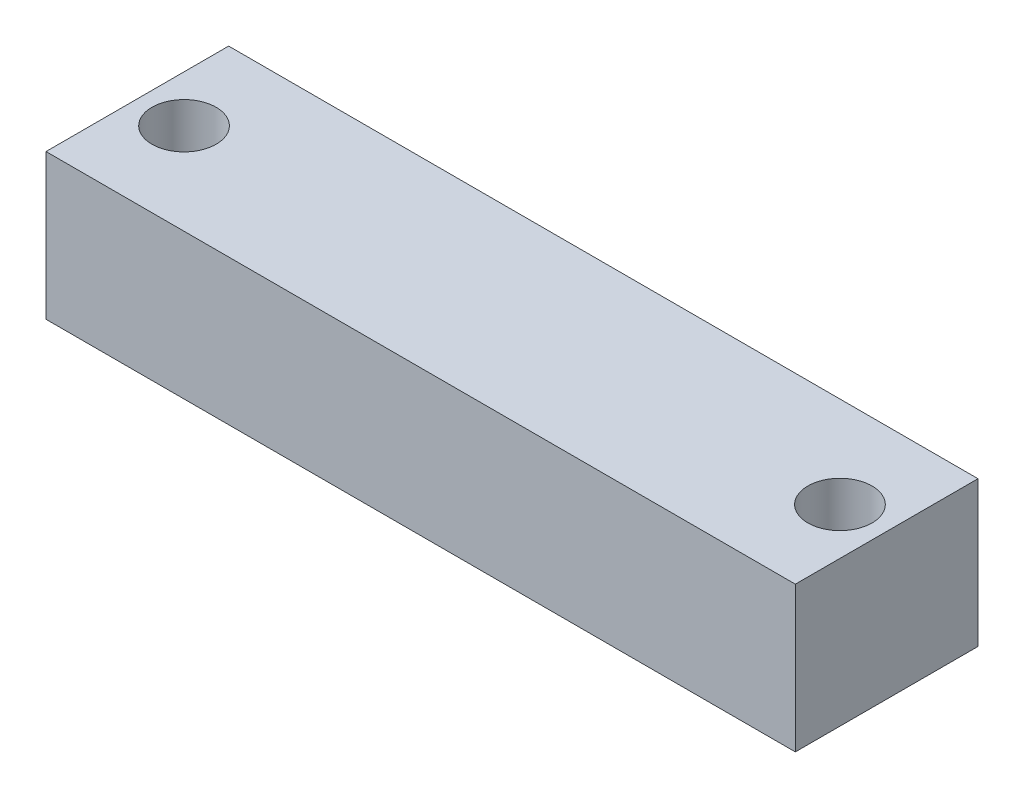
ISO-10303-21;
HEADER;
FILE_DESCRIPTION(('STEP AP214'),'2;1');
FILE_NAME('part.step','',(''),(''),'','','');
FILE_SCHEMA(('AUTOMOTIVE_DESIGN { 1 0 10303 214 1 1 1 1 }'));
ENDSEC;
DATA;
#1=APPLICATION_CONTEXT('core data for automotive mechanical design processes');
#2=APPLICATION_PROTOCOL_DEFINITION('international standard','automotive_design',2000,#1);
#3=PRODUCT_CONTEXT('',#1,'mechanical');
#4=PRODUCT('Part','Part','',(#3));
#5=PRODUCT_RELATED_PRODUCT_CATEGORY('part','',(#4));
#6=PRODUCT_DEFINITION_FORMATION('','',#4);
#7=PRODUCT_DEFINITION_CONTEXT('part definition',#1,'design');
#8=PRODUCT_DEFINITION('design','',#6,#7);
#9=PRODUCT_DEFINITION_SHAPE('','',#8);
#10=(LENGTH_UNIT() NAMED_UNIT(*) SI_UNIT(.MILLI.,.METRE.));
#11=(NAMED_UNIT(*) PLANE_ANGLE_UNIT() SI_UNIT($,.RADIAN.));
#12=(NAMED_UNIT(*) SI_UNIT($,.STERADIAN.) SOLID_ANGLE_UNIT());
#13=UNCERTAINTY_MEASURE_WITH_UNIT(LENGTH_MEASURE(1.E-05),#10,'distance_accuracy_value','');
#14=(GEOMETRIC_REPRESENTATION_CONTEXT(3) GLOBAL_UNCERTAINTY_ASSIGNED_CONTEXT((#13)) GLOBAL_UNIT_ASSIGNED_CONTEXT((#10,
#11,#12)) REPRESENTATION_CONTEXT('',''));
#15=CARTESIAN_POINT('',(0.,0.,0.));
#16=DIRECTION('',(0.,0.,1.));
#17=DIRECTION('',(1.,0.,0.));
#18=AXIS2_PLACEMENT_3D('',#15,#16,#17);
#19=CARTESIAN_POINT('',(39.5,0.,0.));
#20=DIRECTION('',(0.,1.,0.));
#21=DIRECTION('',(0.,0.,1.));
#22=AXIS2_PLACEMENT_3D('',#19,#20,#21);
#23=CYLINDRICAL_SURFACE('',#22,1.5);
#24=CARTESIAN_POINT('',(39.5,0.,0.));
#25=DIRECTION('',(0.,1.,0.));
#26=DIRECTION('',(0.,0.,1.));
#27=AXIS2_PLACEMENT_3D('',#24,#25,#26);
#28=CIRCLE('',#27,1.5);
#29=CARTESIAN_POINT('',(39.5,0.,1.49999999999999));
#30=VERTEX_POINT('',#29);
#31=EDGE_CURVE('E127',#30,#30,#28,.T.);
#32=ORIENTED_EDGE('',*,*,#31,.F.);
#33=EDGE_LOOP('',(#32));
#34=FACE_BOUND('',#33,.T.);
#35=CARTESIAN_POINT('',(39.5,7.5,0.));
#36=DIRECTION('',(0.,1.,0.));
#37=DIRECTION('',(0.,0.,1.));
#38=AXIS2_PLACEMENT_3D('',#35,#36,#37);
#39=CIRCLE('',#38,1.5);
#40=CARTESIAN_POINT('',(39.5,7.5,1.49999999999999));
#41=VERTEX_POINT('',#40);
#42=EDGE_CURVE('E136',#41,#41,#39,.F.);
#43=ORIENTED_EDGE('',*,*,#42,.F.);
#44=EDGE_LOOP('',(#43));
#45=FACE_BOUND('',#44,.T.);
#46=ADVANCED_FACE('F49',(#34,#45),#23,.F.);
#47=CARTESIAN_POINT('',(-39.5,0.,0.));
#48=DIRECTION('',(0.,1.,0.));
#49=DIRECTION('',(0.,0.,1.));
#50=AXIS2_PLACEMENT_3D('',#47,#48,#49);
#51=CYLINDRICAL_SURFACE('',#50,1.5);
#52=CARTESIAN_POINT('',(-39.5,0.,0.));
#53=DIRECTION('',(0.,1.,0.));
#54=DIRECTION('',(0.,0.,1.));
#55=AXIS2_PLACEMENT_3D('',#52,#53,#54);
#56=CIRCLE('',#55,1.5);
#57=CARTESIAN_POINT('',(-39.5,0.,1.5));
#58=VERTEX_POINT('',#57);
#59=EDGE_CURVE('E116',#58,#58,#56,.T.);
#60=ORIENTED_EDGE('',*,*,#59,.F.);
#61=EDGE_LOOP('',(#60));
#62=FACE_BOUND('',#61,.T.);
#63=CARTESIAN_POINT('',(-39.5,7.5,0.));
#64=DIRECTION('',(0.,1.,0.));
#65=DIRECTION('',(0.,0.,1.));
#66=AXIS2_PLACEMENT_3D('',#63,#64,#65);
#67=CIRCLE('',#66,1.5);
#68=CARTESIAN_POINT('',(-39.5,7.5,1.5));
#69=VERTEX_POINT('',#68);
#70=EDGE_CURVE('E145',#69,#69,#67,.F.);
#71=ORIENTED_EDGE('',*,*,#70,.F.);
#72=EDGE_LOOP('',(#71));
#73=FACE_BOUND('',#72,.T.);
#74=ADVANCED_FACE('F154',(#62,#73),#51,.F.);
#75=CARTESIAN_POINT('',(45.125,17.5,11.));
#76=DIRECTION('',(-1.,0.,0.));
#77=DIRECTION('',(0.,0.,1.));
#78=AXIS2_PLACEMENT_3D('',#75,#76,#77);
#79=PLANE('',#78);
#80=DIRECTION('',(0.,0.,-1.));
#81=VECTOR('',#80,1.);
#82=CARTESIAN_POINT('',(45.125,0.,11.));
#83=LINE('',#82,#81);
#84=CARTESIAN_POINT('',(45.125,0.,11.));
#85=VERTEX_POINT('',#84);
#86=CARTESIAN_POINT('',(45.125,0.,-11.));
#87=VERTEX_POINT('',#86);
#88=EDGE_CURVE('E113',#85,#87,#83,.T.);
#89=ORIENTED_EDGE('',*,*,#88,.T.);
#90=DIRECTION('',(0.,-1.,0.));
#91=VECTOR('',#90,1.);
#92=CARTESIAN_POINT('',(45.125,17.5,-11.));
#93=LINE('',#92,#91);
#94=CARTESIAN_POINT('',(45.125,17.5,-11.));
#95=VERTEX_POINT('',#94);
#96=EDGE_CURVE('E11',#95,#87,#93,.T.);
#97=ORIENTED_EDGE('',*,*,#96,.F.);
#98=DIRECTION('',(0.,0.,-1.));
#99=VECTOR('',#98,1.);
#100=CARTESIAN_POINT('',(45.125,17.5,11.));
#101=LINE('',#100,#99);
#102=CARTESIAN_POINT('',(45.125,17.5,11.));
#103=VERTEX_POINT('',#102);
#104=EDGE_CURVE('E101',#103,#95,#101,.T.);
#105=ORIENTED_EDGE('',*,*,#104,.F.);
#106=DIRECTION('',(0.,-1.,0.));
#107=VECTOR('',#106,1.);
#108=CARTESIAN_POINT('',(45.125,17.5,11.));
#109=LINE('',#108,#107);
#110=EDGE_CURVE('E109',#103,#85,#109,.T.);
#111=ORIENTED_EDGE('',*,*,#110,.T.);
#112=EDGE_LOOP('',(#89,#97,#105,#111));
#113=FACE_BOUND('',#112,.T.);
#114=ADVANCED_FACE('F51',(#113),#79,.F.);
#115=CARTESIAN_POINT('',(-45.125,17.5,-11.));
#116=DIRECTION('',(0.,0.,1.));
#117=DIRECTION('',(1.,0.,0.));
#118=AXIS2_PLACEMENT_3D('',#115,#116,#117);
#119=PLANE('',#118);
#120=DIRECTION('',(-1.,0.,0.));
#121=VECTOR('',#120,1.);
#122=CARTESIAN_POINT('',(-45.125,0.,-11.));
#123=LINE('',#122,#121);
#124=CARTESIAN_POINT('',(-45.125,0.,-11.));
#125=VERTEX_POINT('',#124);
#126=EDGE_CURVE('E105',#87,#125,#123,.T.);
#127=ORIENTED_EDGE('',*,*,#126,.T.);
#128=DIRECTION('',(0.,-1.,0.));
#129=VECTOR('',#128,1.);
#130=CARTESIAN_POINT('',(-45.125,17.5,-11.));
#131=LINE('',#130,#129);
#132=CARTESIAN_POINT('',(-45.125,17.5,-11.));
#133=VERTEX_POINT('',#132);
#134=EDGE_CURVE('E58',#133,#125,#131,.T.);
#135=ORIENTED_EDGE('',*,*,#134,.F.);
#136=DIRECTION('',(-1.,0.,0.));
#137=VECTOR('',#136,1.);
#138=CARTESIAN_POINT('',(-45.125,17.5,-11.));
#139=LINE('',#138,#137);
#140=EDGE_CURVE('E96',#95,#133,#139,.T.);
#141=ORIENTED_EDGE('',*,*,#140,.F.);
#142=ORIENTED_EDGE('',*,*,#96,.T.);
#143=EDGE_LOOP('',(#127,#135,#141,#142));
#144=FACE_BOUND('',#143,.T.);
#145=ADVANCED_FACE('F104',(#144),#119,.F.);
#146=CARTESIAN_POINT('',(-45.125,17.5,11.));
#147=DIRECTION('',(1.,0.,0.));
#148=DIRECTION('',(0.,0.,-1.));
#149=AXIS2_PLACEMENT_3D('',#146,#147,#148);
#150=PLANE('',#149);
#151=DIRECTION('',(0.,0.,1.));
#152=VECTOR('',#151,1.);
#153=CARTESIAN_POINT('',(-45.125,0.,11.));
#154=LINE('',#153,#152);
#155=CARTESIAN_POINT('',(-45.125,0.,11.));
#156=VERTEX_POINT('',#155);
#157=EDGE_CURVE('E83',#125,#156,#154,.T.);
#158=ORIENTED_EDGE('',*,*,#157,.T.);
#159=DIRECTION('',(0.,-1.,0.));
#160=VECTOR('',#159,1.);
#161=CARTESIAN_POINT('',(-45.125,17.5,11.));
#162=LINE('',#161,#160);
#163=CARTESIAN_POINT('',(-45.125,17.5,11.));
#164=VERTEX_POINT('',#163);
#165=EDGE_CURVE('E106',#164,#156,#162,.T.);
#166=ORIENTED_EDGE('',*,*,#165,.F.);
#167=DIRECTION('',(0.,0.,1.));
#168=VECTOR('',#167,1.);
#169=CARTESIAN_POINT('',(-45.125,17.5,11.));
#170=LINE('',#169,#168);
#171=EDGE_CURVE('E99',#133,#164,#170,.T.);
#172=ORIENTED_EDGE('',*,*,#171,.F.);
#173=ORIENTED_EDGE('',*,*,#134,.T.);
#174=EDGE_LOOP('',(#158,#166,#172,#173));
#175=FACE_BOUND('',#174,.T.);
#176=ADVANCED_FACE('F107',(#175),#150,.F.);
#177=CARTESIAN_POINT('',(-45.125,17.5,11.));
#178=DIRECTION('',(0.,0.,-1.));
#179=DIRECTION('',(-1.,0.,0.));
#180=AXIS2_PLACEMENT_3D('',#177,#178,#179);
#181=PLANE('',#180);
#182=DIRECTION('',(1.,0.,0.));
#183=VECTOR('',#182,1.);
#184=CARTESIAN_POINT('',(-45.125,0.,11.));
#185=LINE('',#184,#183);
#186=EDGE_CURVE('E89',#156,#85,#185,.T.);
#187=ORIENTED_EDGE('',*,*,#186,.T.);
#188=ORIENTED_EDGE('',*,*,#110,.F.);
#189=DIRECTION('',(1.,0.,0.));
#190=VECTOR('',#189,1.);
#191=CARTESIAN_POINT('',(-45.125,17.5,11.));
#192=LINE('',#191,#190);
#193=EDGE_CURVE('E66',#164,#103,#192,.T.);
#194=ORIENTED_EDGE('',*,*,#193,.F.);
#195=ORIENTED_EDGE('',*,*,#165,.T.);
#196=EDGE_LOOP('',(#187,#188,#194,#195));
#197=FACE_BOUND('',#196,.T.);
#198=ADVANCED_FACE('F121',(#197),#181,.F.);
#199=CARTESIAN_POINT('',(0.,17.5,0.));
#200=DIRECTION('',(0.,-1.,0.));
#201=DIRECTION('',(0.,0.,-1.));
#202=AXIS2_PLACEMENT_3D('',#199,#200,#201);
#203=PLANE('',#202);
#204=CARTESIAN_POINT('',(-39.5,17.5,0.));
#205=DIRECTION('',(0.,1.,0.));
#206=DIRECTION('',(0.,0.,1.));
#207=AXIS2_PLACEMENT_3D('',#204,#205,#206);
#208=CIRCLE('',#207,3.86500000000002);
#209=CARTESIAN_POINT('',(-39.5,17.5,3.86500000000002));
#210=VERTEX_POINT('',#209);
#211=EDGE_CURVE('E140',#210,#210,#208,.T.);
#212=ORIENTED_EDGE('',*,*,#211,.F.);
#213=EDGE_LOOP('',(#212));
#214=FACE_BOUND('',#213,.T.);
#215=CARTESIAN_POINT('',(39.5,17.5,0.));
#216=DIRECTION('',(0.,1.,0.));
#217=DIRECTION('',(0.,0.,1.));
#218=AXIS2_PLACEMENT_3D('',#215,#216,#217);
#219=CIRCLE('',#218,3.86500000000002);
#220=CARTESIAN_POINT('',(39.5,17.5,3.86500000000001));
#221=VERTEX_POINT('',#220);
#222=EDGE_CURVE('E133',#221,#221,#219,.T.);
#223=ORIENTED_EDGE('',*,*,#222,.F.);
#224=EDGE_LOOP('',(#223));
#225=FACE_BOUND('',#224,.T.);
#226=ORIENTED_EDGE('',*,*,#104,.T.);
#227=ORIENTED_EDGE('',*,*,#140,.T.);
#228=ORIENTED_EDGE('',*,*,#171,.T.);
#229=ORIENTED_EDGE('',*,*,#193,.T.);
#230=EDGE_LOOP('',(#226,#227,#228,#229));
#231=FACE_BOUND('',#230,.T.);
#232=ADVANCED_FACE('F97',(#214,#225,#231),#203,.F.);
#233=CARTESIAN_POINT('',(0.,0.,0.));
#234=DIRECTION('',(0.,-1.,0.));
#235=DIRECTION('',(0.,0.,-1.));
#236=AXIS2_PLACEMENT_3D('',#233,#234,#235);
#237=PLANE('',#236);
#238=ORIENTED_EDGE('',*,*,#59,.T.);
#239=EDGE_LOOP('',(#238));
#240=FACE_BOUND('',#239,.T.);
#241=ORIENTED_EDGE('',*,*,#31,.T.);
#242=EDGE_LOOP('',(#241));
#243=FACE_BOUND('',#242,.T.);
#244=ORIENTED_EDGE('',*,*,#88,.F.);
#245=ORIENTED_EDGE('',*,*,#186,.F.);
#246=ORIENTED_EDGE('',*,*,#157,.F.);
#247=ORIENTED_EDGE('',*,*,#126,.F.);
#248=EDGE_LOOP('',(#244,#245,#246,#247));
#249=FACE_BOUND('',#248,.T.);
#250=ADVANCED_FACE('F124',(#240,#243,#249),#237,.T.);
#251=CARTESIAN_POINT('',(-39.5,7.5,0.));
#252=DIRECTION('',(0.,1.,0.));
#253=DIRECTION('',(0.,0.,1.));
#254=AXIS2_PLACEMENT_3D('',#251,#252,#253);
#255=CYLINDRICAL_SURFACE('',#254,3.86500000000002);
#256=CARTESIAN_POINT('',(-39.5,7.5,0.));
#257=DIRECTION('',(0.,1.,0.));
#258=DIRECTION('',(0.,0.,1.));
#259=AXIS2_PLACEMENT_3D('',#256,#257,#258);
#260=CIRCLE('',#259,3.86500000000002);
#261=CARTESIAN_POINT('',(-39.5,7.5,3.86500000000002));
#262=VERTEX_POINT('',#261);
#263=EDGE_CURVE('E130',#262,#262,#260,.T.);
#264=ORIENTED_EDGE('',*,*,#263,.F.);
#265=EDGE_LOOP('',(#264));
#266=FACE_BOUND('',#265,.T.);
#267=ORIENTED_EDGE('',*,*,#211,.T.);
#268=EDGE_LOOP('',(#267));
#269=FACE_BOUND('',#268,.T.);
#270=ADVANCED_FACE('F174',(#266,#269),#255,.F.);
#271=CARTESIAN_POINT('',(0.,7.5,0.));
#272=DIRECTION('',(0.,1.,0.));
#273=DIRECTION('',(0.,0.,1.));
#274=AXIS2_PLACEMENT_3D('',#271,#272,#273);
#275=PLANE('',#274);
#276=ORIENTED_EDGE('',*,*,#70,.T.);
#277=EDGE_LOOP('',(#276));
#278=FACE_BOUND('',#277,.T.);
#279=ORIENTED_EDGE('',*,*,#263,.T.);
#280=EDGE_LOOP('',(#279));
#281=FACE_BOUND('',#280,.T.);
#282=ADVANCED_FACE('F151',(#278,#281),#275,.T.);
#283=CARTESIAN_POINT('',(39.5,7.5,0.));
#284=DIRECTION('',(0.,1.,0.));
#285=DIRECTION('',(0.,0.,1.));
#286=AXIS2_PLACEMENT_3D('',#283,#284,#285);
#287=CYLINDRICAL_SURFACE('',#286,3.86500000000002);
#288=CARTESIAN_POINT('',(39.5,7.5,0.));
#289=DIRECTION('',(0.,1.,0.));
#290=DIRECTION('',(0.,0.,1.));
#291=AXIS2_PLACEMENT_3D('',#288,#289,#290);
#292=CIRCLE('',#291,3.86500000000002);
#293=CARTESIAN_POINT('',(39.5,7.5,3.86500000000001));
#294=VERTEX_POINT('',#293);
#295=EDGE_CURVE('E137',#294,#294,#292,.T.);
#296=ORIENTED_EDGE('',*,*,#295,.F.);
#297=EDGE_LOOP('',(#296));
#298=FACE_BOUND('',#297,.T.);
#299=ORIENTED_EDGE('',*,*,#222,.T.);
#300=EDGE_LOOP('',(#299));
#301=FACE_BOUND('',#300,.T.);
#302=ADVANCED_FACE('F167',(#298,#301),#287,.F.);
#303=CARTESIAN_POINT('',(0.,7.5,0.));
#304=DIRECTION('',(0.,1.,0.));
#305=DIRECTION('',(0.,0.,1.));
#306=AXIS2_PLACEMENT_3D('',#303,#304,#305);
#307=PLANE('',#306);
#308=ORIENTED_EDGE('',*,*,#42,.T.);
#309=EDGE_LOOP('',(#308));
#310=FACE_BOUND('',#309,.T.);
#311=ORIENTED_EDGE('',*,*,#295,.T.);
#312=EDGE_LOOP('',(#311));
#313=FACE_BOUND('',#312,.T.);
#314=ADVANCED_FACE('F231',(#310,#313),#307,.T.);
#315=CLOSED_SHELL('',(#46,#74,#114,#145,#176,#198,#232,#250,#270,#282,#302,#314));
#316=MANIFOLD_SOLID_BREP('B2',#315);
#317=ADVANCED_BREP_SHAPE_REPRESENTATION('',(#18,#316),#14);
#318=SHAPE_DEFINITION_REPRESENTATION(#9,#317);
ENDSEC;
END-ISO-10303-21;
